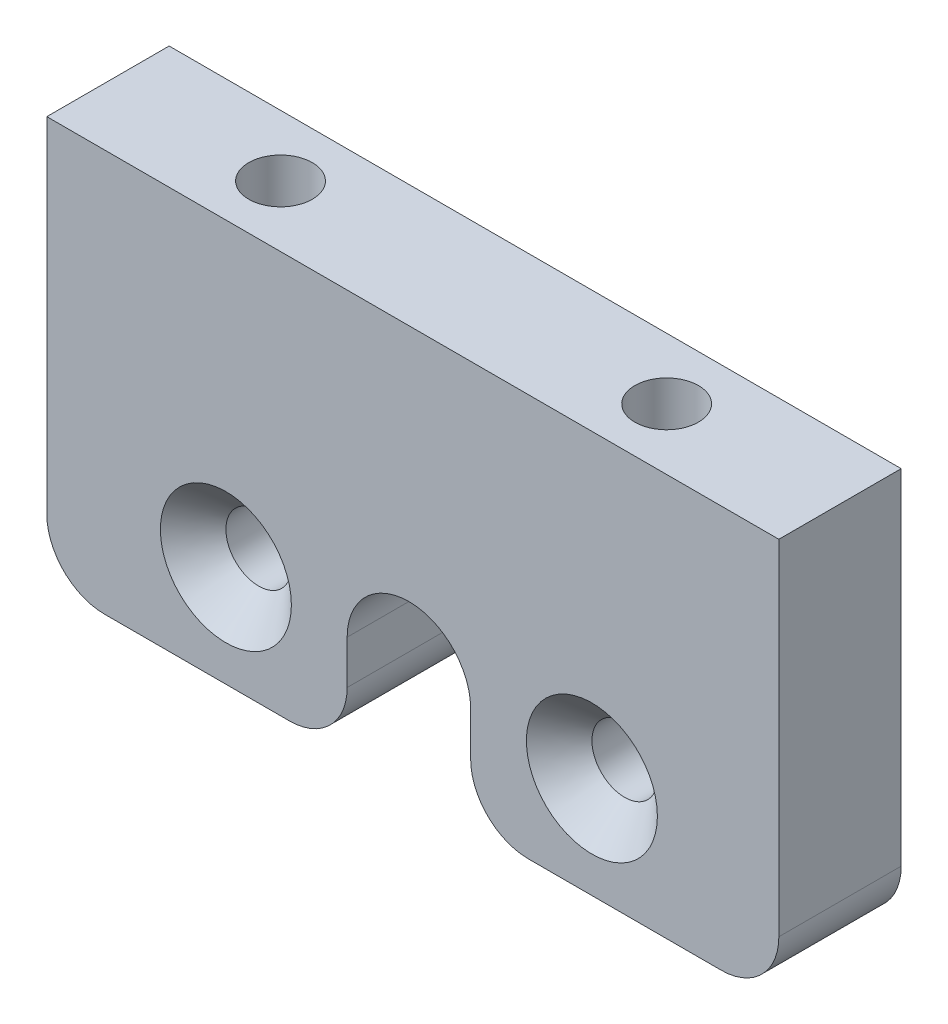
ISO-10303-21;
HEADER;
FILE_DESCRIPTION(('STEP AP214'),'2;1');
FILE_NAME('part.step','',(''),(''),'','','');
FILE_SCHEMA(('AUTOMOTIVE_DESIGN { 1 0 10303 214 1 1 1 1 }'));
ENDSEC;
DATA;
#1=APPLICATION_CONTEXT('core data for automotive mechanical design processes');
#2=APPLICATION_PROTOCOL_DEFINITION('international standard','automotive_design',2000,#1);
#3=PRODUCT_CONTEXT('',#1,'mechanical');
#4=PRODUCT('Part','Part','',(#3));
#5=PRODUCT_RELATED_PRODUCT_CATEGORY('part','',(#4));
#6=PRODUCT_DEFINITION_FORMATION('','',#4);
#7=PRODUCT_DEFINITION_CONTEXT('part definition',#1,'design');
#8=PRODUCT_DEFINITION('design','',#6,#7);
#9=PRODUCT_DEFINITION_SHAPE('','',#8);
#10=(LENGTH_UNIT() NAMED_UNIT(*) SI_UNIT(.MILLI.,.METRE.));
#11=(NAMED_UNIT(*) PLANE_ANGLE_UNIT() SI_UNIT($,.RADIAN.));
#12=(NAMED_UNIT(*) SI_UNIT($,.STERADIAN.) SOLID_ANGLE_UNIT());
#13=UNCERTAINTY_MEASURE_WITH_UNIT(LENGTH_MEASURE(1.E-05),#10,'distance_accuracy_value','');
#14=(GEOMETRIC_REPRESENTATION_CONTEXT(3) GLOBAL_UNCERTAINTY_ASSIGNED_CONTEXT((#13)) GLOBAL_UNIT_ASSIGNED_CONTEXT((#10,
#11,#12)) REPRESENTATION_CONTEXT('',''));
#15=CARTESIAN_POINT('',(0.,0.,0.));
#16=DIRECTION('',(0.,0.,1.));
#17=DIRECTION('',(1.,0.,0.));
#18=AXIS2_PLACEMENT_3D('',#15,#16,#17);
#19=CARTESIAN_POINT('',(-0.204856205085272,7.26253329120006,-15.2948971714696));
#20=DIRECTION('',(-3.50142978646659E-09,0.,1.));
#21=DIRECTION('',(1.,0.,3.50142978646659E-09));
#22=AXIS2_PLACEMENT_3D('',#19,#20,#21);
#23=PLANE('',#22);
#24=CARTESIAN_POINT('',(-9.70485620508527,7.26253329120007,-15.2948972047331));
#25=DIRECTION('',(-3.50142978646659E-09,0.,1.));
#26=DIRECTION('',(1.,0.,3.50142978646659E-09));
#27=AXIS2_PLACEMENT_3D('',#24,#25,#26);
#28=CIRCLE('',#27,3.4);
#29=CARTESIAN_POINT('',(-6.30485620508527,7.26253329120007,-15.2948971928283));
#30=VERTEX_POINT('',#29);
#31=EDGE_CURVE('E166',#30,#30,#28,.F.);
#32=ORIENTED_EDGE('',*,*,#31,.T.);
#33=EDGE_LOOP('',(#32));
#34=FACE_BOUND('',#33,.T.);
#35=CARTESIAN_POINT('',(9.29514379491473,7.26253329120007,-15.294897138206));
#36=DIRECTION('',(-3.50142978646659E-09,0.,1.));
#37=DIRECTION('',(1.,0.,3.50142978646659E-09));
#38=AXIS2_PLACEMENT_3D('',#35,#36,#37);
#39=CIRCLE('',#38,3.4);
#40=CARTESIAN_POINT('',(12.6951437949147,7.26253329120007,-15.2948971263011));
#41=VERTEX_POINT('',#40);
#42=EDGE_CURVE('E157',#41,#41,#39,.F.);
#43=ORIENTED_EDGE('',*,*,#42,.T.);
#44=EDGE_LOOP('',(#43));
#45=FACE_BOUND('',#44,.T.);
#46=DIRECTION('',(0.,-1.,0.));
#47=VECTOR('',#46,1.);
#48=CARTESIAN_POINT('',(-19.0000001968485,22.8686999999994,-15.2948972372794));
#49=LINE('',#48,#47);
#50=CARTESIAN_POINT('',(-19.0000001968485,22.8686999999994,-15.2948972372794));
#51=VERTEX_POINT('',#50);
#52=CARTESIAN_POINT('',(-19.0000001968485,4.99869999999941,-15.2948972372794));
#53=VERTEX_POINT('',#52);
#54=EDGE_CURVE('E242',#51,#53,#49,.T.);
#55=ORIENTED_EDGE('',*,*,#54,.T.);
#56=CARTESIAN_POINT('',(-16.0000001968485,4.99869999999941,-15.2948972267751));
#57=DIRECTION('',(-3.50142978646659E-09,0.,1.));
#58=DIRECTION('',(1.,0.,3.50142978646659E-09));
#59=AXIS2_PLACEMENT_3D('',#56,#57,#58);
#60=CIRCLE('',#59,3.);
#61=CARTESIAN_POINT('',(-16.0000001968485,1.99869999999941,-15.2948972267751));
#62=VERTEX_POINT('',#61);
#63=EDGE_CURVE('E191',#53,#62,#60,.T.);
#64=ORIENTED_EDGE('',*,*,#63,.T.);
#65=DIRECTION('',(1.,0.,3.50142963778684E-09));
#66=VECTOR('',#65,1.);
#67=CARTESIAN_POINT('',(-3.40973421739459,1.99869999999941,-15.2948971826912));
#68=LINE('',#67,#66);
#69=CARTESIAN_POINT('',(-6.40973421739459,1.99869999999941,-15.2948971931955));
#70=VERTEX_POINT('',#69);
#71=EDGE_CURVE('E254',#62,#70,#68,.T.);
#72=ORIENTED_EDGE('',*,*,#71,.T.);
#73=CARTESIAN_POINT('',(-6.40973421739459,4.99869999999941,-15.2948971931955));
#74=DIRECTION('',(-3.50142978646659E-09,0.,1.));
#75=DIRECTION('',(1.,0.,3.50142978646659E-09));
#76=AXIS2_PLACEMENT_3D('',#73,#74,#75);
#77=CIRCLE('',#76,3.);
#78=CARTESIAN_POINT('',(-3.40973421739459,4.99869999999941,-15.2948971826912));
#79=VERTEX_POINT('',#78);
#80=EDGE_CURVE('E53',#70,#79,#77,.T.);
#81=ORIENTED_EDGE('',*,*,#80,.T.);
#82=DIRECTION('',(0.,1.,0.));
#83=VECTOR('',#82,1.);
#84=CARTESIAN_POINT('',(-3.40973421739459,7.26253329120007,-15.2948971826912));
#85=LINE('',#84,#83);
#86=CARTESIAN_POINT('',(-3.40973421739459,7.26253329120007,-15.2948971826912));
#87=VERTEX_POINT('',#86);
#88=EDGE_CURVE('E144',#79,#87,#85,.T.);
#89=ORIENTED_EDGE('',*,*,#88,.T.);
#90=CARTESIAN_POINT('',(-0.204856205085272,7.26253329120006,-15.2948971714696));
#91=DIRECTION('',(3.50142978646659E-09,0.,-1.));
#92=DIRECTION('',(1.,0.,3.50142978646659E-09));
#93=AXIS2_PLACEMENT_3D('',#90,#91,#92);
#94=CIRCLE('',#93,3.20487801230932);
#95=CARTESIAN_POINT('',(3.00002180722404,7.26253329120007,-15.2948971602479));
#96=VERTEX_POINT('',#95);
#97=EDGE_CURVE('E140',#87,#96,#94,.T.);
#98=ORIENTED_EDGE('',*,*,#97,.T.);
#99=DIRECTION('',(0.,-1.,0.));
#100=VECTOR('',#99,1.);
#101=CARTESIAN_POINT('',(3.00002180722404,7.26253329120007,-15.2948971602479));
#102=LINE('',#101,#100);
#103=CARTESIAN_POINT('',(3.00002180722404,4.99869999999985,-15.2948971602479));
#104=VERTEX_POINT('',#103);
#105=EDGE_CURVE('E130',#96,#104,#102,.T.);
#106=ORIENTED_EDGE('',*,*,#105,.T.);
#107=CARTESIAN_POINT('',(6.00002180722404,4.99869999999985,-15.2948971497436));
#108=DIRECTION('',(-3.50142978646659E-09,0.,1.));
#109=DIRECTION('',(1.,0.,3.50142978646659E-09));
#110=AXIS2_PLACEMENT_3D('',#107,#108,#109);
#111=CIRCLE('',#110,3.);
#112=CARTESIAN_POINT('',(6.00002180722404,1.99869999999985,-15.2948971497436));
#113=VERTEX_POINT('',#112);
#114=EDGE_CURVE('E188',#104,#113,#111,.T.);
#115=ORIENTED_EDGE('',*,*,#114,.T.);
#116=DIRECTION('',(1.,0.,3.50142976711151E-09));
#117=VECTOR('',#116,1.);
#118=CARTESIAN_POINT('',(3.00002180722404,1.99869999999985,-15.2948971602479));
#119=LINE('',#118,#117);
#120=CARTESIAN_POINT('',(16.0000003039566,1.99869999999985,-15.2948971147294));
#121=VERTEX_POINT('',#120);
#122=EDGE_CURVE('E139',#113,#121,#119,.T.);
#123=ORIENTED_EDGE('',*,*,#122,.T.);
#124=CARTESIAN_POINT('',(16.0000003039566,4.99869999999985,-15.2948971147294));
#125=DIRECTION('',(-3.50142978646659E-09,0.,1.));
#126=DIRECTION('',(1.,0.,3.50142978646659E-09));
#127=AXIS2_PLACEMENT_3D('',#124,#125,#126);
#128=CIRCLE('',#127,3.);
#129=CARTESIAN_POINT('',(19.0000003039566,4.99869999999985,-15.2948971042251));
#130=VERTEX_POINT('',#129);
#131=EDGE_CURVE('E60',#121,#130,#128,.T.);
#132=ORIENTED_EDGE('',*,*,#131,.T.);
#133=DIRECTION('',(0.,1.,0.));
#134=VECTOR('',#133,1.);
#135=CARTESIAN_POINT('',(19.0000003039566,1.99869999999985,-15.2948971042251));
#136=LINE('',#135,#134);
#137=CARTESIAN_POINT('',(19.0000003039566,22.8686999999994,-15.2948971042251));
#138=VERTEX_POINT('',#137);
#139=EDGE_CURVE('E271',#130,#138,#136,.T.);
#140=ORIENTED_EDGE('',*,*,#139,.T.);
#141=DIRECTION('',(-1.,0.,-3.5014298199321E-09));
#142=VECTOR('',#141,1.);
#143=CARTESIAN_POINT('',(19.0000003039566,22.8686999999994,-15.2948971042251));
#144=LINE('',#143,#142);
#145=EDGE_CURVE('E257',#138,#51,#144,.T.);
#146=ORIENTED_EDGE('',*,*,#145,.T.);
#147=EDGE_LOOP('',(#55,#64,#72,#81,#89,#98,#106,#115,#123,#132,#140,#146));
#148=FACE_BOUND('',#147,.T.);
#149=ADVANCED_FACE('F38',(#34,#45,#148),#23,.T.);
#150=CARTESIAN_POINT('',(-0.204856182851193,7.26253329120006,-21.6448971714696));
#151=DIRECTION('',(-3.50142978646659E-09,0.,1.));
#152=DIRECTION('',(1.,0.,3.50142978646659E-09));
#153=AXIS2_PLACEMENT_3D('',#150,#151,#152);
#154=PLANE('',#153);
#155=DIRECTION('',(1.,0.,3.50142963778684E-09));
#156=VECTOR('',#155,1.);
#157=CARTESIAN_POINT('',(-3.40973419516051,1.99869999999941,-21.6448971826912));
#158=LINE('',#157,#156);
#159=CARTESIAN_POINT('',(-16.0000001746145,1.99869999999941,-21.6448972267751));
#160=VERTEX_POINT('',#159);
#161=CARTESIAN_POINT('',(-6.40973419516051,1.99869999999941,-21.6448971931955));
#162=VERTEX_POINT('',#161);
#163=EDGE_CURVE('E228',#160,#162,#158,.T.);
#164=ORIENTED_EDGE('',*,*,#163,.F.);
#165=CARTESIAN_POINT('',(-16.0000001746145,4.99869999999941,-21.6448972267751));
#166=DIRECTION('',(-3.50142978646659E-09,0.,1.));
#167=DIRECTION('',(1.,0.,3.50142978646659E-09));
#168=AXIS2_PLACEMENT_3D('',#165,#166,#167);
#169=CIRCLE('',#168,3.);
#170=CARTESIAN_POINT('',(-19.0000001746145,4.99869999999941,-21.6448972372794));
#171=VERTEX_POINT('',#170);
#172=EDGE_CURVE('E183',#160,#171,#169,.F.);
#173=ORIENTED_EDGE('',*,*,#172,.T.);
#174=DIRECTION('',(0.,-1.,0.));
#175=VECTOR('',#174,1.);
#176=CARTESIAN_POINT('',(-19.0000001746145,22.8686999999994,-21.6448972372794));
#177=LINE('',#176,#175);
#178=CARTESIAN_POINT('',(-19.0000001746145,22.8686999999994,-21.6448972372794));
#179=VERTEX_POINT('',#178);
#180=EDGE_CURVE('E224',#179,#171,#177,.T.);
#181=ORIENTED_EDGE('',*,*,#180,.F.);
#182=DIRECTION('',(-1.,0.,-3.5014298199321E-09));
#183=VECTOR('',#182,1.);
#184=CARTESIAN_POINT('',(19.0000003261906,22.8686999999994,-21.6448971042251));
#185=LINE('',#184,#183);
#186=CARTESIAN_POINT('',(19.0000003261906,22.8686999999994,-21.6448971042251));
#187=VERTEX_POINT('',#186);
#188=EDGE_CURVE('E217',#187,#179,#185,.T.);
#189=ORIENTED_EDGE('',*,*,#188,.F.);
#190=DIRECTION('',(0.,1.,0.));
#191=VECTOR('',#190,1.);
#192=CARTESIAN_POINT('',(19.0000003261906,1.99869999999985,-21.6448971042251));
#193=LINE('',#192,#191);
#194=CARTESIAN_POINT('',(19.0000003261906,4.99869999999985,-21.6448971042251));
#195=VERTEX_POINT('',#194);
#196=EDGE_CURVE('E214',#195,#187,#193,.T.);
#197=ORIENTED_EDGE('',*,*,#196,.F.);
#198=CARTESIAN_POINT('',(16.0000003261906,4.99869999999985,-21.6448971147294));
#199=DIRECTION('',(-3.50142978646659E-09,0.,1.));
#200=DIRECTION('',(1.,0.,3.50142978646659E-09));
#201=AXIS2_PLACEMENT_3D('',#198,#199,#200);
#202=CIRCLE('',#201,3.);
#203=CARTESIAN_POINT('',(16.0000003261906,1.99869999999985,-21.6448971147294));
#204=VERTEX_POINT('',#203);
#205=EDGE_CURVE('E177',#195,#204,#202,.F.);
#206=ORIENTED_EDGE('',*,*,#205,.T.);
#207=DIRECTION('',(1.,0.,3.50142976711151E-09));
#208=VECTOR('',#207,1.);
#209=CARTESIAN_POINT('',(3.00002182945812,1.99869999999985,-21.6448971602479));
#210=LINE('',#209,#208);
#211=CARTESIAN_POINT('',(6.00002182945812,1.99869999999985,-21.6448971497436));
#212=VERTEX_POINT('',#211);
#213=EDGE_CURVE('E206',#212,#204,#210,.T.);
#214=ORIENTED_EDGE('',*,*,#213,.F.);
#215=CARTESIAN_POINT('',(6.00002182945812,4.99869999999985,-21.6448971497436));
#216=DIRECTION('',(-3.50142978646659E-09,0.,1.));
#217=DIRECTION('',(1.,0.,3.50142978646659E-09));
#218=AXIS2_PLACEMENT_3D('',#215,#216,#217);
#219=CIRCLE('',#218,3.);
#220=CARTESIAN_POINT('',(3.00002182945812,4.99869999999985,-21.6448971602479));
#221=VERTEX_POINT('',#220);
#222=EDGE_CURVE('E179',#212,#221,#219,.F.);
#223=ORIENTED_EDGE('',*,*,#222,.T.);
#224=DIRECTION('',(0.,-1.,0.));
#225=VECTOR('',#224,1.);
#226=CARTESIAN_POINT('',(3.00002182945812,7.26253329120007,-21.6448971602479));
#227=LINE('',#226,#225);
#228=CARTESIAN_POINT('',(3.00002182945812,7.26253329120007,-21.6448971602479));
#229=VERTEX_POINT('',#228);
#230=EDGE_CURVE('E215',#229,#221,#227,.T.);
#231=ORIENTED_EDGE('',*,*,#230,.F.);
#232=CARTESIAN_POINT('',(-0.204856182851193,7.26253329120006,-21.6448971714696));
#233=DIRECTION('',(3.50142978646659E-09,0.,-1.));
#234=DIRECTION('',(1.,0.,3.50142978646659E-09));
#235=AXIS2_PLACEMENT_3D('',#232,#233,#234);
#236=CIRCLE('',#235,3.20487801230932);
#237=CARTESIAN_POINT('',(-3.40973419516051,7.26253329120007,-21.6448971826912));
#238=VERTEX_POINT('',#237);
#239=EDGE_CURVE('E152',#238,#229,#236,.T.);
#240=ORIENTED_EDGE('',*,*,#239,.F.);
#241=DIRECTION('',(0.,1.,0.));
#242=VECTOR('',#241,1.);
#243=CARTESIAN_POINT('',(-3.40973419516051,7.26253329120007,-21.6448971826912));
#244=LINE('',#243,#242);
#245=CARTESIAN_POINT('',(-3.40973419516051,4.99869999999941,-21.6448971826912));
#246=VERTEX_POINT('',#245);
#247=EDGE_CURVE('E148',#246,#238,#244,.T.);
#248=ORIENTED_EDGE('',*,*,#247,.F.);
#249=CARTESIAN_POINT('',(-6.40973419516051,4.99869999999941,-21.6448971931955));
#250=DIRECTION('',(-3.50142978646659E-09,0.,1.));
#251=DIRECTION('',(1.,0.,3.50142978646659E-09));
#252=AXIS2_PLACEMENT_3D('',#249,#250,#251);
#253=CIRCLE('',#252,3.);
#254=EDGE_CURVE('E181',#246,#162,#253,.F.);
#255=ORIENTED_EDGE('',*,*,#254,.T.);
#256=EDGE_LOOP('',(#164,#173,#181,#189,#197,#206,#214,#223,#231,#240,#248,#255));
#257=FACE_BOUND('',#256,.T.);
#258=CARTESIAN_POINT('',(9.2951438171488,7.26253329120007,-21.644897138206));
#259=DIRECTION('',(-3.50142978646659E-09,0.,1.));
#260=DIRECTION('',(1.,0.,3.50142978646659E-09));
#261=AXIS2_PLACEMENT_3D('',#258,#259,#260);
#262=CIRCLE('',#261,1.7);
#263=CARTESIAN_POINT('',(10.9951438171488,7.26253329120007,-21.6448971322535));
#264=VERTEX_POINT('',#263);
#265=EDGE_CURVE('E260',#264,#264,#262,.T.);
#266=ORIENTED_EDGE('',*,*,#265,.T.);
#267=EDGE_LOOP('',(#266));
#268=FACE_BOUND('',#267,.T.);
#269=CARTESIAN_POINT('',(-9.70485618285119,7.26253329120007,-21.6448972047331));
#270=DIRECTION('',(-3.50142978646659E-09,0.,1.));
#271=DIRECTION('',(1.,0.,3.50142978646659E-09));
#272=AXIS2_PLACEMENT_3D('',#269,#270,#271);
#273=CIRCLE('',#272,1.7);
#274=CARTESIAN_POINT('',(-8.00485618285119,7.26253329120007,-21.6448971987807));
#275=VERTEX_POINT('',#274);
#276=EDGE_CURVE('E262',#275,#275,#273,.T.);
#277=ORIENTED_EDGE('',*,*,#276,.T.);
#278=EDGE_LOOP('',(#277));
#279=FACE_BOUND('',#278,.T.);
#280=ADVANCED_FACE('F211',(#257,#268,#279),#154,.F.);
#281=CARTESIAN_POINT('',(-0.204856205085272,7.26253329120006,-15.2948971714696));
#282=DIRECTION('',(3.50142978646659E-09,0.,-1.));
#283=DIRECTION('',(-1.,0.,-3.50142978646659E-09));
#284=AXIS2_PLACEMENT_3D('',#281,#282,#283);
#285=CYLINDRICAL_SURFACE('',#284,3.20487801230932);
#286=ORIENTED_EDGE('',*,*,#239,.T.);
#287=DIRECTION('',(3.50142978646659E-09,0.,-1.));
#288=VECTOR('',#287,1.);
#289=CARTESIAN_POINT('',(3.00002180722404,7.26253329120007,-15.2948971602479));
#290=LINE('',#289,#288);
#291=EDGE_CURVE('E135',#96,#229,#290,.T.);
#292=ORIENTED_EDGE('',*,*,#291,.F.);
#293=ORIENTED_EDGE('',*,*,#97,.F.);
#294=DIRECTION('',(3.50142978646659E-09,0.,-1.));
#295=VECTOR('',#294,1.);
#296=CARTESIAN_POINT('',(-3.40973421739459,7.26253329120007,-15.2948971826912));
#297=LINE('',#296,#295);
#298=EDGE_CURVE('E232',#87,#238,#297,.T.);
#299=ORIENTED_EDGE('',*,*,#298,.T.);
#300=EDGE_LOOP('',(#286,#292,#293,#299));
#301=FACE_BOUND('',#300,.T.);
#302=ADVANCED_FACE('F150',(#301),#285,.F.);
#303=CARTESIAN_POINT('',(3.00002180722404,7.26253329120007,-15.2948971602479));
#304=DIRECTION('',(1.,0.,3.50142978646659E-09));
#305=DIRECTION('',(3.50142978646659E-09,0.,-1.));
#306=AXIS2_PLACEMENT_3D('',#303,#304,#305);
#307=PLANE('',#306);
#308=ORIENTED_EDGE('',*,*,#230,.T.);
#309=DIRECTION('',(3.50142978646659E-09,0.,-1.));
#310=VECTOR('',#309,1.);
#311=CARTESIAN_POINT('',(3.00002180722404,4.99869999999985,-15.2948971602479));
#312=LINE('',#311,#310);
#313=EDGE_CURVE('E46',#221,#104,#312,.F.);
#314=ORIENTED_EDGE('',*,*,#313,.T.);
#315=ORIENTED_EDGE('',*,*,#105,.F.);
#316=ORIENTED_EDGE('',*,*,#291,.T.);
#317=EDGE_LOOP('',(#308,#314,#315,#316));
#318=FACE_BOUND('',#317,.T.);
#319=ADVANCED_FACE('F133',(#318),#307,.F.);
#320=CARTESIAN_POINT('',(3.00002180722404,1.99869999999985,-15.2948971602479));
#321=DIRECTION('',(0.,1.,0.));
#322=DIRECTION('',(0.,0.,1.));
#323=AXIS2_PLACEMENT_3D('',#320,#321,#322);
#324=PLANE('',#323);
#325=ORIENTED_EDGE('',*,*,#122,.F.);
#326=DIRECTION('',(3.50142978646659E-09,0.,-1.));
#327=VECTOR('',#326,1.);
#328=CARTESIAN_POINT('',(6.00002180722404,1.99869999999985,-15.2948971497436));
#329=LINE('',#328,#327);
#330=EDGE_CURVE('E198',#113,#212,#329,.T.);
#331=ORIENTED_EDGE('',*,*,#330,.T.);
#332=ORIENTED_EDGE('',*,*,#213,.T.);
#333=DIRECTION('',(3.50142978646659E-09,0.,-1.));
#334=VECTOR('',#333,1.);
#335=CARTESIAN_POINT('',(16.0000003039566,1.99869999999985,-15.2948971147294));
#336=LINE('',#335,#334);
#337=EDGE_CURVE('E196',#204,#121,#336,.F.);
#338=ORIENTED_EDGE('',*,*,#337,.T.);
#339=EDGE_LOOP('',(#325,#331,#332,#338));
#340=FACE_BOUND('',#339,.T.);
#341=ADVANCED_FACE('F205',(#340),#324,.F.);
#342=CARTESIAN_POINT('',(19.0000003039566,1.99869999999985,-15.2948971042251));
#343=DIRECTION('',(-1.,0.,-3.50142978646659E-09));
#344=DIRECTION('',(-3.50142978646659E-09,0.,1.));
#345=AXIS2_PLACEMENT_3D('',#342,#343,#344);
#346=PLANE('',#345);
#347=ORIENTED_EDGE('',*,*,#139,.F.);
#348=DIRECTION('',(3.50142978646659E-09,0.,-1.));
#349=VECTOR('',#348,1.);
#350=CARTESIAN_POINT('',(19.0000003039566,4.99869999999985,-15.2948971042251));
#351=LINE('',#350,#349);
#352=EDGE_CURVE('E11',#130,#195,#351,.T.);
#353=ORIENTED_EDGE('',*,*,#352,.T.);
#354=ORIENTED_EDGE('',*,*,#196,.T.);
#355=DIRECTION('',(3.50142978646659E-09,0.,-1.));
#356=VECTOR('',#355,1.);
#357=CARTESIAN_POINT('',(19.0000003039566,22.8686999999994,-15.2948971042251));
#358=LINE('',#357,#356);
#359=EDGE_CURVE('E154',#138,#187,#358,.T.);
#360=ORIENTED_EDGE('',*,*,#359,.F.);
#361=EDGE_LOOP('',(#347,#353,#354,#360));
#362=FACE_BOUND('',#361,.T.);
#363=ADVANCED_FACE('F278',(#362),#346,.F.);
#364=CARTESIAN_POINT('',(19.0000003039566,22.8686999999994,-15.2948971042251));
#365=DIRECTION('',(0.,-1.,0.));
#366=DIRECTION('',(1.,0.,0.));
#367=AXIS2_PLACEMENT_3D('',#364,#365,#366);
#368=PLANE('',#367);
#369=CARTESIAN_POINT('',(-10.0428502580598,22.8686999999994,-18.4698971042251));
#370=DIRECTION('',(0.,1.,0.));
#371=DIRECTION('',(-1.,0.,0.));
#372=AXIS2_PLACEMENT_3D('',#369,#370,#371);
#373=CIRCLE('',#372,1.65);
#374=CARTESIAN_POINT('',(-11.6928502580598,22.8686999999994,-18.4698971042251));
#375=VERTEX_POINT('',#374);
#376=EDGE_CURVE('E500',#375,#375,#373,.T.);
#377=ORIENTED_EDGE('',*,*,#376,.F.);
#378=EDGE_LOOP('',(#377));
#379=FACE_BOUND('',#378,.T.);
#380=CARTESIAN_POINT('',(10.,22.8686999999994,-18.4698971042251));
#381=DIRECTION('',(0.,1.,0.));
#382=DIRECTION('',(-1.,0.,0.));
#383=AXIS2_PLACEMENT_3D('',#380,#381,#382);
#384=CIRCLE('',#383,1.65);
#385=CARTESIAN_POINT('',(8.35,22.8686999999994,-18.4698971042251));
#386=VERTEX_POINT('',#385);
#387=EDGE_CURVE('E495',#386,#386,#384,.T.);
#388=ORIENTED_EDGE('',*,*,#387,.F.);
#389=EDGE_LOOP('',(#388));
#390=FACE_BOUND('',#389,.T.);
#391=ORIENTED_EDGE('',*,*,#188,.T.);
#392=DIRECTION('',(3.50142978646659E-09,0.,-1.));
#393=VECTOR('',#392,1.);
#394=CARTESIAN_POINT('',(-19.0000001968485,22.8686999999994,-15.2948972372794));
#395=LINE('',#394,#393);
#396=EDGE_CURVE('E160',#51,#179,#395,.T.);
#397=ORIENTED_EDGE('',*,*,#396,.F.);
#398=ORIENTED_EDGE('',*,*,#145,.F.);
#399=ORIENTED_EDGE('',*,*,#359,.T.);
#400=EDGE_LOOP('',(#391,#397,#398,#399));
#401=FACE_BOUND('',#400,.T.);
#402=ADVANCED_FACE('F276',(#379,#390,#401),#368,.F.);
#403=CARTESIAN_POINT('',(-19.0000001968485,22.8686999999994,-15.2948972372794));
#404=DIRECTION('',(1.,0.,3.50142978646659E-09));
#405=DIRECTION('',(3.50142978646659E-09,0.,-1.));
#406=AXIS2_PLACEMENT_3D('',#403,#404,#405);
#407=PLANE('',#406);
#408=ORIENTED_EDGE('',*,*,#180,.T.);
#409=DIRECTION('',(3.50142978646659E-09,0.,-1.));
#410=VECTOR('',#409,1.);
#411=CARTESIAN_POINT('',(-19.0000001968485,4.99869999999941,-15.2948972372794));
#412=LINE('',#411,#410);
#413=EDGE_CURVE('E185',#171,#53,#412,.F.);
#414=ORIENTED_EDGE('',*,*,#413,.T.);
#415=ORIENTED_EDGE('',*,*,#54,.F.);
#416=ORIENTED_EDGE('',*,*,#396,.T.);
#417=EDGE_LOOP('',(#408,#414,#415,#416));
#418=FACE_BOUND('',#417,.T.);
#419=ADVANCED_FACE('F240',(#418),#407,.F.);
#420=CARTESIAN_POINT('',(-3.40973421739459,1.99869999999941,-15.2948971826912));
#421=DIRECTION('',(0.,1.,0.));
#422=DIRECTION('',(-1.,0.,0.));
#423=AXIS2_PLACEMENT_3D('',#420,#421,#422);
#424=PLANE('',#423);
#425=ORIENTED_EDGE('',*,*,#71,.F.);
#426=DIRECTION('',(3.50142978646659E-09,0.,-1.));
#427=VECTOR('',#426,1.);
#428=CARTESIAN_POINT('',(-16.0000001968485,1.99869999999941,-15.2948972267751));
#429=LINE('',#428,#427);
#430=EDGE_CURVE('E174',#62,#160,#429,.T.);
#431=ORIENTED_EDGE('',*,*,#430,.T.);
#432=ORIENTED_EDGE('',*,*,#163,.T.);
#433=DIRECTION('',(3.50142978646659E-09,0.,-1.));
#434=VECTOR('',#433,1.);
#435=CARTESIAN_POINT('',(-6.40973421739459,1.99869999999941,-15.2948971931955));
#436=LINE('',#435,#434);
#437=EDGE_CURVE('E172',#162,#70,#436,.F.);
#438=ORIENTED_EDGE('',*,*,#437,.T.);
#439=EDGE_LOOP('',(#425,#431,#432,#438));
#440=FACE_BOUND('',#439,.T.);
#441=ADVANCED_FACE('F252',(#440),#424,.F.);
#442=CARTESIAN_POINT('',(-3.40973421739459,7.26253329120007,-15.2948971826912));
#443=DIRECTION('',(-1.,0.,-3.50142978646659E-09));
#444=DIRECTION('',(-3.50142978646659E-09,0.,1.));
#445=AXIS2_PLACEMENT_3D('',#442,#443,#444);
#446=PLANE('',#445);
#447=ORIENTED_EDGE('',*,*,#88,.F.);
#448=DIRECTION('',(3.50142978646659E-09,0.,-1.));
#449=VECTOR('',#448,1.);
#450=CARTESIAN_POINT('',(-3.40973421739459,4.99869999999941,-15.2948971826912));
#451=LINE('',#450,#449);
#452=EDGE_CURVE('E193',#79,#246,#451,.T.);
#453=ORIENTED_EDGE('',*,*,#452,.T.);
#454=ORIENTED_EDGE('',*,*,#247,.T.);
#455=ORIENTED_EDGE('',*,*,#298,.F.);
#456=EDGE_LOOP('',(#447,#453,#454,#455));
#457=FACE_BOUND('',#456,.T.);
#458=ADVANCED_FACE('F302',(#457),#446,.F.);
#459=CARTESIAN_POINT('',(9.29514379491473,7.26253329120007,-15.294897138206));
#460=DIRECTION('',(3.50142978646659E-09,0.,-1.));
#461=DIRECTION('',(-1.,0.,-3.50142978646659E-09));
#462=AXIS2_PLACEMENT_3D('',#459,#460,#461);
#463=CYLINDRICAL_SURFACE('',#462,1.7);
#464=CARTESIAN_POINT('',(9.29514380086716,7.26253329120007,-16.994897138206));
#465=DIRECTION('',(-3.50143015072276E-09,0.,1.));
#466=DIRECTION('',(1.,0.,3.50143015072276E-09));
#467=AXIS2_PLACEMENT_3D('',#464,#465,#466);
#468=CIRCLE('',#467,1.7);
#469=CARTESIAN_POINT('',(10.9951438008672,7.26253329120007,-16.9948971322535));
#470=VERTEX_POINT('',#469);
#471=EDGE_CURVE('E169',#470,#470,#468,.T.);
#472=ORIENTED_EDGE('',*,*,#471,.T.);
#473=EDGE_LOOP('',(#472));
#474=FACE_BOUND('',#473,.T.);
#475=ORIENTED_EDGE('',*,*,#265,.F.);
#476=EDGE_LOOP('',(#475));
#477=FACE_BOUND('',#476,.T.);
#478=ADVANCED_FACE('F299',(#474,#477),#463,.F.);
#479=CARTESIAN_POINT('',(-9.70485620508527,7.26253329120007,-15.2948972047331));
#480=DIRECTION('',(3.50142978646659E-09,0.,-1.));
#481=DIRECTION('',(-1.,0.,-3.50142978646659E-09));
#482=AXIS2_PLACEMENT_3D('',#479,#480,#481);
#483=CYLINDRICAL_SURFACE('',#482,1.7);
#484=CARTESIAN_POINT('',(-9.70485619913284,7.26253329120007,-16.9948972047331));
#485=DIRECTION('',(-3.50143015072276E-09,0.,1.));
#486=DIRECTION('',(1.,0.,3.50143015072276E-09));
#487=AXIS2_PLACEMENT_3D('',#484,#485,#486);
#488=CIRCLE('',#487,1.7);
#489=CARTESIAN_POINT('',(-8.00485619913284,7.26253329120007,-16.9948971987807));
#490=VERTEX_POINT('',#489);
#491=EDGE_CURVE('E153',#490,#490,#488,.T.);
#492=ORIENTED_EDGE('',*,*,#491,.T.);
#493=EDGE_LOOP('',(#492));
#494=FACE_BOUND('',#493,.T.);
#495=ORIENTED_EDGE('',*,*,#276,.F.);
#496=EDGE_LOOP('',(#495));
#497=FACE_BOUND('',#496,.T.);
#498=ADVANCED_FACE('F325',(#494,#497),#483,.F.);
#499=CARTESIAN_POINT('',(-9.70485619913284,7.26253329120007,-16.9948972047331));
#500=DIRECTION('',(-3.50143015072276E-09,0.,1.));
#501=DIRECTION('',(1.,0.,3.50143015072276E-09));
#502=AXIS2_PLACEMENT_3D('',#499,#500,#501);
#503=CONICAL_SURFACE('',#502,1.7,0.78539816339745);
#504=ORIENTED_EDGE('',*,*,#31,.F.);
#505=EDGE_LOOP('',(#504));
#506=FACE_BOUND('',#505,.T.);
#507=ORIENTED_EDGE('',*,*,#491,.F.);
#508=EDGE_LOOP('',(#507));
#509=FACE_BOUND('',#508,.T.);
#510=ADVANCED_FACE('F321',(#506,#509),#503,.F.);
#511=CARTESIAN_POINT('',(9.29514380086716,7.26253329120007,-16.994897138206));
#512=DIRECTION('',(-3.50143015072276E-09,0.,1.));
#513=DIRECTION('',(1.,0.,3.50143015072276E-09));
#514=AXIS2_PLACEMENT_3D('',#511,#512,#513);
#515=CONICAL_SURFACE('',#514,1.7,0.78539816339745);
#516=ORIENTED_EDGE('',*,*,#42,.F.);
#517=EDGE_LOOP('',(#516));
#518=FACE_BOUND('',#517,.T.);
#519=ORIENTED_EDGE('',*,*,#471,.F.);
#520=EDGE_LOOP('',(#519));
#521=FACE_BOUND('',#520,.T.);
#522=ADVANCED_FACE('F324',(#518,#521),#515,.F.);
#523=CARTESIAN_POINT('',(10.,12.8686999999994,-18.4698971042251));
#524=DIRECTION('',(0.,1.,0.));
#525=DIRECTION('',(-1.,0.,0.));
#526=AXIS2_PLACEMENT_3D('',#523,#524,#525);
#527=CYLINDRICAL_SURFACE('',#526,1.65);
#528=CARTESIAN_POINT('',(10.,12.8686999999994,-18.4698971042251));
#529=DIRECTION('',(0.,1.,0.));
#530=DIRECTION('',(-1.,0.,0.));
#531=AXIS2_PLACEMENT_3D('',#528,#529,#530);
#532=CIRCLE('',#531,1.65);
#533=CARTESIAN_POINT('',(8.35,12.8686999999994,-18.4698971042251));
#534=VERTEX_POINT('',#533);
#535=EDGE_CURVE('E266',#534,#534,#532,.T.);
#536=ORIENTED_EDGE('',*,*,#535,.F.);
#537=EDGE_LOOP('',(#536));
#538=FACE_BOUND('',#537,.T.);
#539=ORIENTED_EDGE('',*,*,#387,.T.);
#540=EDGE_LOOP('',(#539));
#541=FACE_BOUND('',#540,.T.);
#542=ADVANCED_FACE('F329',(#538,#541),#527,.F.);
#543=CARTESIAN_POINT('',(10.,12.8686999999994,-18.4698971042251));
#544=DIRECTION('',(0.,1.,0.));
#545=DIRECTION('',(-1.,0.,0.));
#546=AXIS2_PLACEMENT_3D('',#543,#544,#545);
#547=PLANE('',#546);
#548=ORIENTED_EDGE('',*,*,#535,.T.);
#549=EDGE_LOOP('',(#548));
#550=FACE_BOUND('',#549,.T.);
#551=ADVANCED_FACE('F342',(#550),#547,.T.);
#552=CARTESIAN_POINT('',(-10.0428502580598,12.8686999999994,-18.4698971042251));
#553=DIRECTION('',(0.,1.,0.));
#554=DIRECTION('',(-1.,0.,0.));
#555=AXIS2_PLACEMENT_3D('',#552,#553,#554);
#556=CYLINDRICAL_SURFACE('',#555,1.65);
#557=CARTESIAN_POINT('',(-10.0428502580598,12.8686999999994,-18.4698971042251));
#558=DIRECTION('',(0.,1.,0.));
#559=DIRECTION('',(-1.,0.,0.));
#560=AXIS2_PLACEMENT_3D('',#557,#558,#559);
#561=CIRCLE('',#560,1.65);
#562=CARTESIAN_POINT('',(-11.6928502580598,12.8686999999994,-18.4698971042251));
#563=VERTEX_POINT('',#562);
#564=EDGE_CURVE('E497',#563,#563,#561,.T.);
#565=ORIENTED_EDGE('',*,*,#564,.F.);
#566=EDGE_LOOP('',(#565));
#567=FACE_BOUND('',#566,.T.);
#568=ORIENTED_EDGE('',*,*,#376,.T.);
#569=EDGE_LOOP('',(#568));
#570=FACE_BOUND('',#569,.T.);
#571=ADVANCED_FACE('F336',(#567,#570),#556,.F.);
#572=CARTESIAN_POINT('',(-10.0428502580598,12.8686999999994,-18.4698971042251));
#573=DIRECTION('',(0.,1.,0.));
#574=DIRECTION('',(-1.,0.,0.));
#575=AXIS2_PLACEMENT_3D('',#572,#573,#574);
#576=PLANE('',#575);
#577=ORIENTED_EDGE('',*,*,#564,.T.);
#578=EDGE_LOOP('',(#577));
#579=FACE_BOUND('',#578,.T.);
#580=ADVANCED_FACE('F332',(#579),#576,.T.);
#581=CARTESIAN_POINT('',(-16.0000001968485,4.99869999999941,-15.2948972267751));
#582=DIRECTION('',(3.50142978646659E-09,0.,-1.));
#583=DIRECTION('',(-1.,0.,-3.50142978646659E-09));
#584=AXIS2_PLACEMENT_3D('',#581,#582,#583);
#585=CYLINDRICAL_SURFACE('',#584,3.);
#586=ORIENTED_EDGE('',*,*,#63,.F.);
#587=ORIENTED_EDGE('',*,*,#413,.F.);
#588=ORIENTED_EDGE('',*,*,#172,.F.);
#589=ORIENTED_EDGE('',*,*,#430,.F.);
#590=EDGE_LOOP('',(#586,#587,#588,#589));
#591=FACE_BOUND('',#590,.T.);
#592=ADVANCED_FACE('F249',(#591),#585,.T.);
#593=CARTESIAN_POINT('',(-6.40973421739459,4.99869999999941,-15.2948971931955));
#594=DIRECTION('',(3.50142978646659E-09,0.,-1.));
#595=DIRECTION('',(-1.,0.,-3.50142978646659E-09));
#596=AXIS2_PLACEMENT_3D('',#593,#594,#595);
#597=CYLINDRICAL_SURFACE('',#596,3.);
#598=ORIENTED_EDGE('',*,*,#80,.F.);
#599=ORIENTED_EDGE('',*,*,#437,.F.);
#600=ORIENTED_EDGE('',*,*,#254,.F.);
#601=ORIENTED_EDGE('',*,*,#452,.F.);
#602=EDGE_LOOP('',(#598,#599,#600,#601));
#603=FACE_BOUND('',#602,.T.);
#604=ADVANCED_FACE('F283',(#603),#597,.T.);
#605=CARTESIAN_POINT('',(6.00002180722404,4.99869999999985,-15.2948971497436));
#606=DIRECTION('',(3.50142978646659E-09,0.,-1.));
#607=DIRECTION('',(-1.,0.,-3.50142978646659E-09));
#608=AXIS2_PLACEMENT_3D('',#605,#606,#607);
#609=CYLINDRICAL_SURFACE('',#608,3.);
#610=ORIENTED_EDGE('',*,*,#114,.F.);
#611=ORIENTED_EDGE('',*,*,#313,.F.);
#612=ORIENTED_EDGE('',*,*,#222,.F.);
#613=ORIENTED_EDGE('',*,*,#330,.F.);
#614=EDGE_LOOP('',(#610,#611,#612,#613));
#615=FACE_BOUND('',#614,.T.);
#616=ADVANCED_FACE('F281',(#615),#609,.T.);
#617=CARTESIAN_POINT('',(16.0000003039566,4.99869999999985,-15.2948971147294));
#618=DIRECTION('',(3.50142978646659E-09,0.,-1.));
#619=DIRECTION('',(-1.,0.,-3.50142978646659E-09));
#620=AXIS2_PLACEMENT_3D('',#617,#618,#619);
#621=CYLINDRICAL_SURFACE('',#620,3.);
#622=ORIENTED_EDGE('',*,*,#131,.F.);
#623=ORIENTED_EDGE('',*,*,#337,.F.);
#624=ORIENTED_EDGE('',*,*,#205,.F.);
#625=ORIENTED_EDGE('',*,*,#352,.F.);
#626=EDGE_LOOP('',(#622,#623,#624,#625));
#627=FACE_BOUND('',#626,.T.);
#628=ADVANCED_FACE('F40',(#627),#621,.T.);
#629=CLOSED_SHELL('',(#149,#280,#302,#319,#341,#363,#402,#419,#441,#458,#478,#498,#510,#522,
#542,#551,#571,#580,#592,#604,#616,#628));
#630=MANIFOLD_SOLID_BREP('B2',#629);
#631=ADVANCED_BREP_SHAPE_REPRESENTATION('',(#18,#630),#14);
#632=SHAPE_DEFINITION_REPRESENTATION(#9,#631);
ENDSEC;
END-ISO-10303-21;
